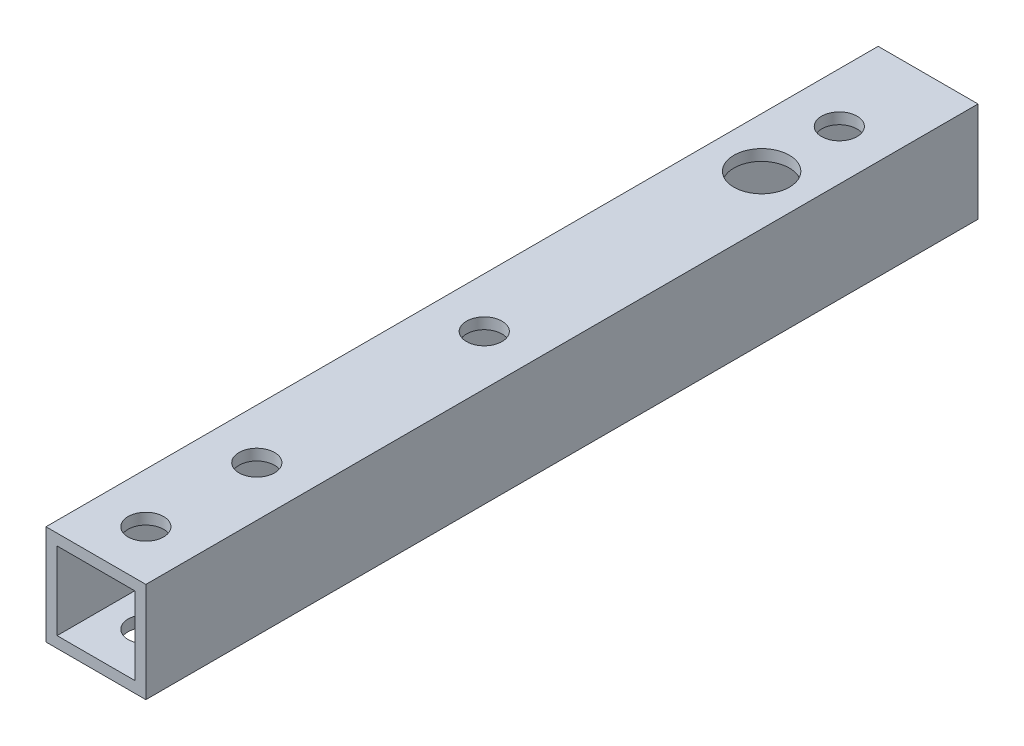
ISO-10303-21;
HEADER;
FILE_DESCRIPTION(('STEP AP214'),'2;1');
FILE_NAME('part.step','',(''),(''),'','','');
FILE_SCHEMA(('AUTOMOTIVE_DESIGN { 1 0 10303 214 1 1 1 1 }'));
ENDSEC;
DATA;
#1=APPLICATION_CONTEXT('core data for automotive mechanical design processes');
#2=APPLICATION_PROTOCOL_DEFINITION('international standard','automotive_design',2000,#1);
#3=PRODUCT_CONTEXT('',#1,'mechanical');
#4=PRODUCT('Part','Part','',(#3));
#5=PRODUCT_RELATED_PRODUCT_CATEGORY('part','',(#4));
#6=PRODUCT_DEFINITION_FORMATION('','',#4);
#7=PRODUCT_DEFINITION_CONTEXT('part definition',#1,'design');
#8=PRODUCT_DEFINITION('design','',#6,#7);
#9=PRODUCT_DEFINITION_SHAPE('','',#8);
#10=(LENGTH_UNIT() NAMED_UNIT(*) SI_UNIT(.MILLI.,.METRE.));
#11=(NAMED_UNIT(*) PLANE_ANGLE_UNIT() SI_UNIT($,.RADIAN.));
#12=(NAMED_UNIT(*) SI_UNIT($,.STERADIAN.) SOLID_ANGLE_UNIT());
#13=UNCERTAINTY_MEASURE_WITH_UNIT(LENGTH_MEASURE(1.E-05),#10,'distance_accuracy_value','');
#14=(GEOMETRIC_REPRESENTATION_CONTEXT(3) GLOBAL_UNCERTAINTY_ASSIGNED_CONTEXT((#13)) GLOBAL_UNIT_ASSIGNED_CONTEXT((#10,
#11,#12)) REPRESENTATION_CONTEXT('',''));
#15=CARTESIAN_POINT('',(0.,0.,0.));
#16=DIRECTION('',(0.,0.,1.));
#17=DIRECTION('',(1.,0.,0.));
#18=AXIS2_PLACEMENT_3D('',#15,#16,#17);
#19=CARTESIAN_POINT('',(0.,0.,70.));
#20=DIRECTION('',(0.,0.,1.));
#21=DIRECTION('',(1.,0.,0.));
#22=AXIS2_PLACEMENT_3D('',#19,#20,#21);
#23=PLANE('',#22);
#24=DIRECTION('',(0.,1.,0.));
#25=VECTOR('',#24,1.);
#26=CARTESIAN_POINT('',(4.5,4.5,70.));
#27=LINE('',#26,#25);
#28=CARTESIAN_POINT('',(4.5,-4.5,70.));
#29=VERTEX_POINT('',#28);
#30=CARTESIAN_POINT('',(4.5,4.5,70.));
#31=VERTEX_POINT('',#30);
#32=EDGE_CURVE('E213',#29,#31,#27,.T.);
#33=ORIENTED_EDGE('',*,*,#32,.T.);
#34=DIRECTION('',(-1.,0.,0.));
#35=VECTOR('',#34,1.);
#36=CARTESIAN_POINT('',(-4.5,4.5,70.));
#37=LINE('',#36,#35);
#38=CARTESIAN_POINT('',(-4.5,4.5,70.));
#39=VERTEX_POINT('',#38);
#40=EDGE_CURVE('E215',#31,#39,#37,.T.);
#41=ORIENTED_EDGE('',*,*,#40,.T.);
#42=DIRECTION('',(0.,-1.,0.));
#43=VECTOR('',#42,1.);
#44=CARTESIAN_POINT('',(-4.5,4.5,70.));
#45=LINE('',#44,#43);
#46=CARTESIAN_POINT('',(-4.5,-4.5,70.));
#47=VERTEX_POINT('',#46);
#48=EDGE_CURVE('E217',#39,#47,#45,.T.);
#49=ORIENTED_EDGE('',*,*,#48,.T.);
#50=DIRECTION('',(1.,0.,0.));
#51=VECTOR('',#50,1.);
#52=CARTESIAN_POINT('',(-4.5,-4.5,70.));
#53=LINE('',#52,#51);
#54=EDGE_CURVE('E73',#47,#29,#53,.T.);
#55=ORIENTED_EDGE('',*,*,#54,.T.);
#56=EDGE_LOOP('',(#33,#41,#49,#55));
#57=FACE_BOUND('',#56,.T.);
#58=DIRECTION('',(-1.,0.,0.));
#59=VECTOR('',#58,1.);
#60=CARTESIAN_POINT('',(-3.5,3.5,70.));
#61=LINE('',#60,#59);
#62=CARTESIAN_POINT('',(3.5,3.5,70.));
#63=VERTEX_POINT('',#62);
#64=CARTESIAN_POINT('',(-3.5,3.5,70.));
#65=VERTEX_POINT('',#64);
#66=EDGE_CURVE('E204',#63,#65,#61,.T.);
#67=ORIENTED_EDGE('',*,*,#66,.F.);
#68=DIRECTION('',(0.,1.,0.));
#69=VECTOR('',#68,1.);
#70=CARTESIAN_POINT('',(3.5,3.5,70.));
#71=LINE('',#70,#69);
#72=CARTESIAN_POINT('',(3.5,-3.5,70.));
#73=VERTEX_POINT('',#72);
#74=EDGE_CURVE('E202',#73,#63,#71,.T.);
#75=ORIENTED_EDGE('',*,*,#74,.F.);
#76=DIRECTION('',(1.,0.,0.));
#77=VECTOR('',#76,1.);
#78=CARTESIAN_POINT('',(-3.5,-3.5,70.));
#79=LINE('',#78,#77);
#80=CARTESIAN_POINT('',(-3.5,-3.5,70.));
#81=VERTEX_POINT('',#80);
#82=EDGE_CURVE('E120',#81,#73,#79,.T.);
#83=ORIENTED_EDGE('',*,*,#82,.F.);
#84=DIRECTION('',(0.,-1.,0.));
#85=VECTOR('',#84,1.);
#86=CARTESIAN_POINT('',(-3.5,3.5,70.));
#87=LINE('',#86,#85);
#88=EDGE_CURVE('E206',#65,#81,#87,.T.);
#89=ORIENTED_EDGE('',*,*,#88,.F.);
#90=EDGE_LOOP('',(#67,#75,#83,#89));
#91=FACE_BOUND('',#90,.T.);
#92=ADVANCED_FACE('F48',(#57,#91),#23,.T.);
#93=CARTESIAN_POINT('',(4.5,4.5,70.));
#94=DIRECTION('',(-1.,0.,0.));
#95=DIRECTION('',(0.,-1.,0.));
#96=AXIS2_PLACEMENT_3D('',#93,#94,#95);
#97=PLANE('',#96);
#98=DIRECTION('',(0.,0.,-1.));
#99=VECTOR('',#98,1.);
#100=CARTESIAN_POINT('',(4.5,-4.5,70.));
#101=LINE('',#100,#99);
#102=CARTESIAN_POINT('',(4.5,-4.5,-5.));
#103=VERTEX_POINT('',#102);
#104=EDGE_CURVE('E220',#29,#103,#101,.T.);
#105=ORIENTED_EDGE('',*,*,#104,.T.);
#106=DIRECTION('',(0.,-1.,0.));
#107=VECTOR('',#106,1.);
#108=CARTESIAN_POINT('',(4.5,-4.5,-5.));
#109=LINE('',#108,#107);
#110=CARTESIAN_POINT('',(4.5,4.5,-5.));
#111=VERTEX_POINT('',#110);
#112=EDGE_CURVE('E141',#111,#103,#109,.T.);
#113=ORIENTED_EDGE('',*,*,#112,.F.);
#114=DIRECTION('',(0.,0.,-1.));
#115=VECTOR('',#114,1.);
#116=CARTESIAN_POINT('',(4.5,4.5,70.));
#117=LINE('',#116,#115);
#118=EDGE_CURVE('E12',#31,#111,#117,.T.);
#119=ORIENTED_EDGE('',*,*,#118,.F.);
#120=ORIENTED_EDGE('',*,*,#32,.F.);
#121=EDGE_LOOP('',(#105,#113,#119,#120));
#122=FACE_BOUND('',#121,.T.);
#123=ADVANCED_FACE('F50',(#122),#97,.F.);
#124=CARTESIAN_POINT('',(-4.5,4.5,70.));
#125=DIRECTION('',(0.,-1.,0.));
#126=DIRECTION('',(0.,0.,-1.));
#127=AXIS2_PLACEMENT_3D('',#124,#125,#126);
#128=PLANE('',#127);
#129=CARTESIAN_POINT('',(0.,4.5,35.));
#130=DIRECTION('',(0.,1.,0.));
#131=DIRECTION('',(0.,0.,1.));
#132=AXIS2_PLACEMENT_3D('',#129,#130,#131);
#133=CIRCLE('',#132,1.6);
#134=CARTESIAN_POINT('',(0.,4.5,36.6));
#135=VERTEX_POINT('',#134);
#136=EDGE_CURVE('E153',#135,#135,#133,.T.);
#137=ORIENTED_EDGE('',*,*,#136,.F.);
#138=EDGE_LOOP('',(#137));
#139=FACE_BOUND('',#138,.T.);
#140=CARTESIAN_POINT('',(0.,4.5,55.5));
#141=DIRECTION('',(0.,1.,0.));
#142=DIRECTION('',(0.,0.,1.));
#143=AXIS2_PLACEMENT_3D('',#140,#141,#142);
#144=CIRCLE('',#143,1.6);
#145=CARTESIAN_POINT('',(0.,4.5,57.1));
#146=VERTEX_POINT('',#145);
#147=EDGE_CURVE('E163',#146,#146,#144,.T.);
#148=ORIENTED_EDGE('',*,*,#147,.F.);
#149=EDGE_LOOP('',(#148));
#150=FACE_BOUND('',#149,.T.);
#151=CARTESIAN_POINT('',(0.,4.5,65.5));
#152=DIRECTION('',(0.,1.,0.));
#153=DIRECTION('',(0.,0.,1.));
#154=AXIS2_PLACEMENT_3D('',#151,#152,#153);
#155=CIRCLE('',#154,1.6);
#156=CARTESIAN_POINT('',(0.,4.5,67.1));
#157=VERTEX_POINT('',#156);
#158=EDGE_CURVE('E162',#157,#157,#155,.T.);
#159=ORIENTED_EDGE('',*,*,#158,.F.);
#160=EDGE_LOOP('',(#159));
#161=FACE_BOUND('',#160,.T.);
#162=CARTESIAN_POINT('',(0.,4.5,3.));
#163=DIRECTION('',(0.,1.,0.));
#164=DIRECTION('',(0.,0.,1.));
#165=AXIS2_PLACEMENT_3D('',#162,#163,#164);
#166=CIRCLE('',#165,1.6);
#167=CARTESIAN_POINT('',(0.,4.5,4.6));
#168=VERTEX_POINT('',#167);
#169=EDGE_CURVE('E182',#168,#168,#166,.T.);
#170=ORIENTED_EDGE('',*,*,#169,.F.);
#171=EDGE_LOOP('',(#170));
#172=FACE_BOUND('',#171,.T.);
#173=CARTESIAN_POINT('',(0.,4.5,10.));
#174=DIRECTION('',(0.,1.,0.));
#175=DIRECTION('',(0.,0.,1.));
#176=AXIS2_PLACEMENT_3D('',#173,#174,#175);
#177=CIRCLE('',#176,2.5);
#178=CARTESIAN_POINT('',(0.,4.5,12.5));
#179=VERTEX_POINT('',#178);
#180=EDGE_CURVE('E192',#179,#179,#177,.T.);
#181=ORIENTED_EDGE('',*,*,#180,.F.);
#182=EDGE_LOOP('',(#181));
#183=FACE_BOUND('',#182,.T.);
#184=ORIENTED_EDGE('',*,*,#118,.T.);
#185=DIRECTION('',(1.,0.,0.));
#186=VECTOR('',#185,1.);
#187=CARTESIAN_POINT('',(-4.5,4.5,-5.));
#188=LINE('',#187,#186);
#189=CARTESIAN_POINT('',(-4.5,4.5,-5.));
#190=VERTEX_POINT('',#189);
#191=EDGE_CURVE('E150',#190,#111,#188,.T.);
#192=ORIENTED_EDGE('',*,*,#191,.F.);
#193=DIRECTION('',(0.,0.,-1.));
#194=VECTOR('',#193,1.);
#195=CARTESIAN_POINT('',(-4.5,4.5,70.));
#196=LINE('',#195,#194);
#197=EDGE_CURVE('E57',#39,#190,#196,.T.);
#198=ORIENTED_EDGE('',*,*,#197,.F.);
#199=ORIENTED_EDGE('',*,*,#40,.F.);
#200=EDGE_LOOP('',(#184,#192,#198,#199));
#201=FACE_BOUND('',#200,.T.);
#202=ADVANCED_FACE('F270',(#139,#150,#161,#172,#183,#201),#128,.F.);
#203=CARTESIAN_POINT('',(-4.5,4.5,70.));
#204=DIRECTION('',(1.,0.,0.));
#205=DIRECTION('',(0.,1.,0.));
#206=AXIS2_PLACEMENT_3D('',#203,#204,#205);
#207=PLANE('',#206);
#208=ORIENTED_EDGE('',*,*,#197,.T.);
#209=DIRECTION('',(0.,1.,0.));
#210=VECTOR('',#209,1.);
#211=CARTESIAN_POINT('',(-4.5,-4.5,-5.));
#212=LINE('',#211,#210);
#213=CARTESIAN_POINT('',(-4.5,-4.5,-5.));
#214=VERTEX_POINT('',#213);
#215=EDGE_CURVE('E147',#214,#190,#212,.T.);
#216=ORIENTED_EDGE('',*,*,#215,.F.);
#217=DIRECTION('',(0.,0.,-1.));
#218=VECTOR('',#217,1.);
#219=CARTESIAN_POINT('',(-4.5,-4.5,70.));
#220=LINE('',#219,#218);
#221=EDGE_CURVE('E222',#47,#214,#220,.T.);
#222=ORIENTED_EDGE('',*,*,#221,.F.);
#223=ORIENTED_EDGE('',*,*,#48,.F.);
#224=EDGE_LOOP('',(#208,#216,#222,#223));
#225=FACE_BOUND('',#224,.T.);
#226=ADVANCED_FACE('F257',(#225),#207,.F.);
#227=CARTESIAN_POINT('',(-4.5,-4.5,70.));
#228=DIRECTION('',(0.,1.,0.));
#229=DIRECTION('',(0.,0.,1.));
#230=AXIS2_PLACEMENT_3D('',#227,#228,#229);
#231=PLANE('',#230);
#232=CARTESIAN_POINT('',(0.,-4.5,35.));
#233=DIRECTION('',(0.,1.,0.));
#234=DIRECTION('',(0.,0.,1.));
#235=AXIS2_PLACEMENT_3D('',#232,#233,#234);
#236=CIRCLE('',#235,1.6);
#237=CARTESIAN_POINT('',(0.,-4.5,36.6));
#238=VERTEX_POINT('',#237);
#239=EDGE_CURVE('E154',#238,#238,#236,.T.);
#240=ORIENTED_EDGE('',*,*,#239,.T.);
#241=EDGE_LOOP('',(#240));
#242=FACE_BOUND('',#241,.T.);
#243=CARTESIAN_POINT('',(0.,-4.5,55.5));
#244=DIRECTION('',(0.,1.,0.));
#245=DIRECTION('',(0.,0.,1.));
#246=AXIS2_PLACEMENT_3D('',#243,#244,#245);
#247=CIRCLE('',#246,1.6);
#248=CARTESIAN_POINT('',(0.,-4.5,57.1));
#249=VERTEX_POINT('',#248);
#250=EDGE_CURVE('E179',#249,#249,#247,.T.);
#251=ORIENTED_EDGE('',*,*,#250,.T.);
#252=EDGE_LOOP('',(#251));
#253=FACE_BOUND('',#252,.T.);
#254=CARTESIAN_POINT('',(0.,-4.5,65.5));
#255=DIRECTION('',(0.,1.,0.));
#256=DIRECTION('',(0.,0.,1.));
#257=AXIS2_PLACEMENT_3D('',#254,#255,#256);
#258=CIRCLE('',#257,1.6);
#259=CARTESIAN_POINT('',(0.,-4.5,67.1));
#260=VERTEX_POINT('',#259);
#261=EDGE_CURVE('E172',#260,#260,#258,.T.);
#262=ORIENTED_EDGE('',*,*,#261,.T.);
#263=EDGE_LOOP('',(#262));
#264=FACE_BOUND('',#263,.T.);
#265=CARTESIAN_POINT('',(0.,-4.5,3.));
#266=DIRECTION('',(0.,1.,0.));
#267=DIRECTION('',(0.,0.,1.));
#268=AXIS2_PLACEMENT_3D('',#265,#266,#267);
#269=CIRCLE('',#268,1.6);
#270=CARTESIAN_POINT('',(0.,-4.5,4.6));
#271=VERTEX_POINT('',#270);
#272=EDGE_CURVE('E189',#271,#271,#269,.T.);
#273=ORIENTED_EDGE('',*,*,#272,.T.);
#274=EDGE_LOOP('',(#273));
#275=FACE_BOUND('',#274,.T.);
#276=CARTESIAN_POINT('',(0.,-4.5,10.));
#277=DIRECTION('',(0.,1.,0.));
#278=DIRECTION('',(0.,0.,1.));
#279=AXIS2_PLACEMENT_3D('',#276,#277,#278);
#280=CIRCLE('',#279,2.5);
#281=CARTESIAN_POINT('',(0.,-4.5,12.5));
#282=VERTEX_POINT('',#281);
#283=EDGE_CURVE('E199',#282,#282,#280,.T.);
#284=ORIENTED_EDGE('',*,*,#283,.T.);
#285=EDGE_LOOP('',(#284));
#286=FACE_BOUND('',#285,.T.);
#287=ORIENTED_EDGE('',*,*,#221,.T.);
#288=DIRECTION('',(-1.,0.,0.));
#289=VECTOR('',#288,1.);
#290=CARTESIAN_POINT('',(-4.5,-4.5,-5.));
#291=LINE('',#290,#289);
#292=EDGE_CURVE('E144',#103,#214,#291,.T.);
#293=ORIENTED_EDGE('',*,*,#292,.F.);
#294=ORIENTED_EDGE('',*,*,#104,.F.);
#295=ORIENTED_EDGE('',*,*,#54,.F.);
#296=EDGE_LOOP('',(#287,#293,#294,#295));
#297=FACE_BOUND('',#296,.T.);
#298=ADVANCED_FACE('F254',(#242,#253,#264,#275,#286,#297),#231,.F.);
#299=CARTESIAN_POINT('',(3.5,3.5,70.));
#300=DIRECTION('',(-1.,0.,0.));
#301=DIRECTION('',(0.,-1.,0.));
#302=AXIS2_PLACEMENT_3D('',#299,#300,#301);
#303=PLANE('',#302);
#304=DIRECTION('',(0.,0.,-1.));
#305=VECTOR('',#304,1.);
#306=CARTESIAN_POINT('',(3.5,3.5,70.));
#307=LINE('',#306,#305);
#308=CARTESIAN_POINT('',(3.5,3.5,-5.));
#309=VERTEX_POINT('',#308);
#310=EDGE_CURVE('E128',#63,#309,#307,.T.);
#311=ORIENTED_EDGE('',*,*,#310,.T.);
#312=DIRECTION('',(0.,-1.,0.));
#313=VECTOR('',#312,1.);
#314=CARTESIAN_POINT('',(3.5,-3.5,-5.));
#315=LINE('',#314,#313);
#316=CARTESIAN_POINT('',(3.5,-3.5,-5.));
#317=VERTEX_POINT('',#316);
#318=EDGE_CURVE('E125',#309,#317,#315,.T.);
#319=ORIENTED_EDGE('',*,*,#318,.T.);
#320=DIRECTION('',(0.,0.,-1.));
#321=VECTOR('',#320,1.);
#322=CARTESIAN_POINT('',(3.5,-3.5,70.));
#323=LINE('',#322,#321);
#324=EDGE_CURVE('E113',#73,#317,#323,.T.);
#325=ORIENTED_EDGE('',*,*,#324,.F.);
#326=ORIENTED_EDGE('',*,*,#74,.T.);
#327=EDGE_LOOP('',(#311,#319,#325,#326));
#328=FACE_BOUND('',#327,.T.);
#329=ADVANCED_FACE('F126',(#328),#303,.T.);
#330=CARTESIAN_POINT('',(-3.5,3.5,70.));
#331=DIRECTION('',(0.,-1.,0.));
#332=DIRECTION('',(0.,0.,-1.));
#333=AXIS2_PLACEMENT_3D('',#330,#331,#332);
#334=PLANE('',#333);
#335=CARTESIAN_POINT('',(0.,3.5,35.));
#336=DIRECTION('',(0.,-1.,0.));
#337=DIRECTION('',(0.,0.,-1.));
#338=AXIS2_PLACEMENT_3D('',#335,#336,#337);
#339=CIRCLE('',#338,1.6);
#340=CARTESIAN_POINT('',(0.,3.5,33.4));
#341=VERTEX_POINT('',#340);
#342=EDGE_CURVE('E159',#341,#341,#339,.T.);
#343=ORIENTED_EDGE('',*,*,#342,.F.);
#344=EDGE_LOOP('',(#343));
#345=FACE_BOUND('',#344,.T.);
#346=CARTESIAN_POINT('',(0.,3.5,55.5));
#347=DIRECTION('',(0.,-1.,0.));
#348=DIRECTION('',(0.,0.,-1.));
#349=AXIS2_PLACEMENT_3D('',#346,#347,#348);
#350=CIRCLE('',#349,1.6);
#351=CARTESIAN_POINT('',(0.,3.5,53.9));
#352=VERTEX_POINT('',#351);
#353=EDGE_CURVE('E176',#352,#352,#350,.T.);
#354=ORIENTED_EDGE('',*,*,#353,.F.);
#355=EDGE_LOOP('',(#354));
#356=FACE_BOUND('',#355,.T.);
#357=CARTESIAN_POINT('',(0.,3.5,65.5));
#358=DIRECTION('',(0.,-1.,0.));
#359=DIRECTION('',(0.,0.,-1.));
#360=AXIS2_PLACEMENT_3D('',#357,#358,#359);
#361=CIRCLE('',#360,1.6);
#362=CARTESIAN_POINT('',(0.,3.5,63.9));
#363=VERTEX_POINT('',#362);
#364=EDGE_CURVE('E169',#363,#363,#361,.T.);
#365=ORIENTED_EDGE('',*,*,#364,.F.);
#366=EDGE_LOOP('',(#365));
#367=FACE_BOUND('',#366,.T.);
#368=CARTESIAN_POINT('',(0.,3.5,3.));
#369=DIRECTION('',(0.,-1.,0.));
#370=DIRECTION('',(0.,0.,-1.));
#371=AXIS2_PLACEMENT_3D('',#368,#369,#370);
#372=CIRCLE('',#371,1.6);
#373=CARTESIAN_POINT('',(0.,3.5,1.4));
#374=VERTEX_POINT('',#373);
#375=EDGE_CURVE('E186',#374,#374,#372,.T.);
#376=ORIENTED_EDGE('',*,*,#375,.F.);
#377=EDGE_LOOP('',(#376));
#378=FACE_BOUND('',#377,.T.);
#379=CARTESIAN_POINT('',(0.,3.5,10.));
#380=DIRECTION('',(0.,-1.,0.));
#381=DIRECTION('',(0.,0.,-1.));
#382=AXIS2_PLACEMENT_3D('',#379,#380,#381);
#383=CIRCLE('',#382,2.5);
#384=CARTESIAN_POINT('',(0.,3.5,7.5));
#385=VERTEX_POINT('',#384);
#386=EDGE_CURVE('E196',#385,#385,#383,.T.);
#387=ORIENTED_EDGE('',*,*,#386,.F.);
#388=EDGE_LOOP('',(#387));
#389=FACE_BOUND('',#388,.T.);
#390=DIRECTION('',(0.,0.,-1.));
#391=VECTOR('',#390,1.);
#392=CARTESIAN_POINT('',(-3.5,3.5,70.));
#393=LINE('',#392,#391);
#394=CARTESIAN_POINT('',(-3.5,3.5,-5.));
#395=VERTEX_POINT('',#394);
#396=EDGE_CURVE('E210',#65,#395,#393,.T.);
#397=ORIENTED_EDGE('',*,*,#396,.T.);
#398=DIRECTION('',(1.,0.,0.));
#399=VECTOR('',#398,1.);
#400=CARTESIAN_POINT('',(-3.5,3.5,-5.));
#401=LINE('',#400,#399);
#402=EDGE_CURVE('E137',#395,#309,#401,.T.);
#403=ORIENTED_EDGE('',*,*,#402,.T.);
#404=ORIENTED_EDGE('',*,*,#310,.F.);
#405=ORIENTED_EDGE('',*,*,#66,.T.);
#406=EDGE_LOOP('',(#397,#403,#404,#405));
#407=FACE_BOUND('',#406,.T.);
#408=ADVANCED_FACE('F281',(#345,#356,#367,#378,#389,#407),#334,.T.);
#409=CARTESIAN_POINT('',(-3.5,3.5,70.));
#410=DIRECTION('',(1.,0.,0.));
#411=DIRECTION('',(0.,1.,0.));
#412=AXIS2_PLACEMENT_3D('',#409,#410,#411);
#413=PLANE('',#412);
#414=DIRECTION('',(0.,0.,-1.));
#415=VECTOR('',#414,1.);
#416=CARTESIAN_POINT('',(-3.5,-3.5,70.));
#417=LINE('',#416,#415);
#418=CARTESIAN_POINT('',(-3.5,-3.5,-5.));
#419=VERTEX_POINT('',#418);
#420=EDGE_CURVE('E65',#81,#419,#417,.T.);
#421=ORIENTED_EDGE('',*,*,#420,.T.);
#422=DIRECTION('',(0.,1.,0.));
#423=VECTOR('',#422,1.);
#424=CARTESIAN_POINT('',(-3.5,-3.5,-5.));
#425=LINE('',#424,#423);
#426=EDGE_CURVE('E135',#419,#395,#425,.T.);
#427=ORIENTED_EDGE('',*,*,#426,.T.);
#428=ORIENTED_EDGE('',*,*,#396,.F.);
#429=ORIENTED_EDGE('',*,*,#88,.T.);
#430=EDGE_LOOP('',(#421,#427,#428,#429));
#431=FACE_BOUND('',#430,.T.);
#432=ADVANCED_FACE('F239',(#431),#413,.T.);
#433=CARTESIAN_POINT('',(-3.5,-3.5,70.));
#434=DIRECTION('',(0.,1.,0.));
#435=DIRECTION('',(0.,0.,1.));
#436=AXIS2_PLACEMENT_3D('',#433,#434,#435);
#437=PLANE('',#436);
#438=CARTESIAN_POINT('',(0.,-3.5,35.));
#439=DIRECTION('',(0.,1.,0.));
#440=DIRECTION('',(0.,0.,1.));
#441=AXIS2_PLACEMENT_3D('',#438,#439,#440);
#442=CIRCLE('',#441,1.6);
#443=CARTESIAN_POINT('',(0.,-3.5,36.6));
#444=VERTEX_POINT('',#443);
#445=EDGE_CURVE('E52',#444,#444,#442,.T.);
#446=ORIENTED_EDGE('',*,*,#445,.F.);
#447=EDGE_LOOP('',(#446));
#448=FACE_BOUND('',#447,.T.);
#449=CARTESIAN_POINT('',(0.,-3.5,55.5));
#450=DIRECTION('',(0.,1.,0.));
#451=DIRECTION('',(0.,0.,1.));
#452=AXIS2_PLACEMENT_3D('',#449,#450,#451);
#453=CIRCLE('',#452,1.6);
#454=CARTESIAN_POINT('',(0.,-3.5,57.1));
#455=VERTEX_POINT('',#454);
#456=EDGE_CURVE('E175',#455,#455,#453,.T.);
#457=ORIENTED_EDGE('',*,*,#456,.F.);
#458=EDGE_LOOP('',(#457));
#459=FACE_BOUND('',#458,.T.);
#460=CARTESIAN_POINT('',(0.,-3.5,65.5));
#461=DIRECTION('',(0.,1.,0.));
#462=DIRECTION('',(0.,0.,1.));
#463=AXIS2_PLACEMENT_3D('',#460,#461,#462);
#464=CIRCLE('',#463,1.6);
#465=CARTESIAN_POINT('',(0.,-3.5,67.1));
#466=VERTEX_POINT('',#465);
#467=EDGE_CURVE('E166',#466,#466,#464,.T.);
#468=ORIENTED_EDGE('',*,*,#467,.F.);
#469=EDGE_LOOP('',(#468));
#470=FACE_BOUND('',#469,.T.);
#471=CARTESIAN_POINT('',(0.,-3.5,3.));
#472=DIRECTION('',(0.,1.,0.));
#473=DIRECTION('',(0.,0.,1.));
#474=AXIS2_PLACEMENT_3D('',#471,#472,#473);
#475=CIRCLE('',#474,1.6);
#476=CARTESIAN_POINT('',(0.,-3.5,4.6));
#477=VERTEX_POINT('',#476);
#478=EDGE_CURVE('E185',#477,#477,#475,.T.);
#479=ORIENTED_EDGE('',*,*,#478,.F.);
#480=EDGE_LOOP('',(#479));
#481=FACE_BOUND('',#480,.T.);
#482=CARTESIAN_POINT('',(0.,-3.5,10.));
#483=DIRECTION('',(0.,1.,0.));
#484=DIRECTION('',(0.,0.,1.));
#485=AXIS2_PLACEMENT_3D('',#482,#483,#484);
#486=CIRCLE('',#485,2.5);
#487=CARTESIAN_POINT('',(0.,-3.5,12.5));
#488=VERTEX_POINT('',#487);
#489=EDGE_CURVE('E195',#488,#488,#486,.T.);
#490=ORIENTED_EDGE('',*,*,#489,.F.);
#491=EDGE_LOOP('',(#490));
#492=FACE_BOUND('',#491,.T.);
#493=ORIENTED_EDGE('',*,*,#324,.T.);
#494=DIRECTION('',(-1.,0.,0.));
#495=VECTOR('',#494,1.);
#496=CARTESIAN_POINT('',(-3.5,-3.5,-5.));
#497=LINE('',#496,#495);
#498=EDGE_CURVE('E117',#317,#419,#497,.T.);
#499=ORIENTED_EDGE('',*,*,#498,.T.);
#500=ORIENTED_EDGE('',*,*,#420,.F.);
#501=ORIENTED_EDGE('',*,*,#82,.T.);
#502=EDGE_LOOP('',(#493,#499,#500,#501));
#503=FACE_BOUND('',#502,.T.);
#504=ADVANCED_FACE('F115',(#448,#459,#470,#481,#492,#503),#437,.T.);
#505=CARTESIAN_POINT('',(0.,-95.5,10.));
#506=DIRECTION('',(0.,1.,0.));
#507=DIRECTION('',(0.,0.,1.));
#508=AXIS2_PLACEMENT_3D('',#505,#506,#507);
#509=CYLINDRICAL_SURFACE('',#508,2.5);
#510=ORIENTED_EDGE('',*,*,#489,.T.);
#511=EDGE_LOOP('',(#510));
#512=FACE_BOUND('',#511,.T.);
#513=ORIENTED_EDGE('',*,*,#283,.F.);
#514=EDGE_LOOP('',(#513));
#515=FACE_BOUND('',#514,.T.);
#516=ADVANCED_FACE('F238',(#512,#515),#509,.F.);
#517=ORIENTED_EDGE('',*,*,#386,.T.);
#518=EDGE_LOOP('',(#517));
#519=FACE_BOUND('',#518,.T.);
#520=ORIENTED_EDGE('',*,*,#180,.T.);
#521=EDGE_LOOP('',(#520));
#522=FACE_BOUND('',#521,.T.);
#523=ADVANCED_FACE('F250',(#519,#522),#509,.F.);
#524=CARTESIAN_POINT('',(0.,-95.5,3.));
#525=DIRECTION('',(0.,1.,0.));
#526=DIRECTION('',(0.,0.,1.));
#527=AXIS2_PLACEMENT_3D('',#524,#525,#526);
#528=CYLINDRICAL_SURFACE('',#527,1.6);
#529=ORIENTED_EDGE('',*,*,#478,.T.);
#530=EDGE_LOOP('',(#529));
#531=FACE_BOUND('',#530,.T.);
#532=ORIENTED_EDGE('',*,*,#272,.F.);
#533=EDGE_LOOP('',(#532));
#534=FACE_BOUND('',#533,.T.);
#535=ADVANCED_FACE('F310',(#531,#534),#528,.F.);
#536=ORIENTED_EDGE('',*,*,#375,.T.);
#537=EDGE_LOOP('',(#536));
#538=FACE_BOUND('',#537,.T.);
#539=ORIENTED_EDGE('',*,*,#169,.T.);
#540=EDGE_LOOP('',(#539));
#541=FACE_BOUND('',#540,.T.);
#542=ADVANCED_FACE('F315',(#538,#541),#528,.F.);
#543=CARTESIAN_POINT('',(0.,-95.5,65.5));
#544=DIRECTION('',(0.,1.,0.));
#545=DIRECTION('',(0.,0.,1.));
#546=AXIS2_PLACEMENT_3D('',#543,#544,#545);
#547=CYLINDRICAL_SURFACE('',#546,1.6);
#548=ORIENTED_EDGE('',*,*,#467,.T.);
#549=EDGE_LOOP('',(#548));
#550=FACE_BOUND('',#549,.T.);
#551=ORIENTED_EDGE('',*,*,#261,.F.);
#552=EDGE_LOOP('',(#551));
#553=FACE_BOUND('',#552,.T.);
#554=ADVANCED_FACE('F319',(#550,#553),#547,.F.);
#555=CARTESIAN_POINT('',(0.,-95.5,55.5));
#556=DIRECTION('',(0.,1.,0.));
#557=DIRECTION('',(0.,0.,1.));
#558=AXIS2_PLACEMENT_3D('',#555,#556,#557);
#559=CYLINDRICAL_SURFACE('',#558,1.6);
#560=ORIENTED_EDGE('',*,*,#456,.T.);
#561=EDGE_LOOP('',(#560));
#562=FACE_BOUND('',#561,.T.);
#563=ORIENTED_EDGE('',*,*,#250,.F.);
#564=EDGE_LOOP('',(#563));
#565=FACE_BOUND('',#564,.T.);
#566=ADVANCED_FACE('F233',(#562,#565),#559,.F.);
#567=ORIENTED_EDGE('',*,*,#364,.T.);
#568=EDGE_LOOP('',(#567));
#569=FACE_BOUND('',#568,.T.);
#570=ORIENTED_EDGE('',*,*,#158,.T.);
#571=EDGE_LOOP('',(#570));
#572=FACE_BOUND('',#571,.T.);
#573=ADVANCED_FACE('F323',(#569,#572),#547,.F.);
#574=ORIENTED_EDGE('',*,*,#353,.T.);
#575=EDGE_LOOP('',(#574));
#576=FACE_BOUND('',#575,.T.);
#577=ORIENTED_EDGE('',*,*,#147,.T.);
#578=EDGE_LOOP('',(#577));
#579=FACE_BOUND('',#578,.T.);
#580=ADVANCED_FACE('F326',(#576,#579),#559,.F.);
#581=CARTESIAN_POINT('',(0.,-4.5,35.));
#582=DIRECTION('',(0.,1.,0.));
#583=DIRECTION('',(0.,0.,1.));
#584=AXIS2_PLACEMENT_3D('',#581,#582,#583);
#585=CYLINDRICAL_SURFACE('',#584,1.6);
#586=ORIENTED_EDGE('',*,*,#445,.T.);
#587=EDGE_LOOP('',(#586));
#588=FACE_BOUND('',#587,.T.);
#589=ORIENTED_EDGE('',*,*,#239,.F.);
#590=EDGE_LOOP('',(#589));
#591=FACE_BOUND('',#590,.T.);
#592=ADVANCED_FACE('F327',(#588,#591),#585,.F.);
#593=ORIENTED_EDGE('',*,*,#342,.T.);
#594=EDGE_LOOP('',(#593));
#595=FACE_BOUND('',#594,.T.);
#596=ORIENTED_EDGE('',*,*,#136,.T.);
#597=EDGE_LOOP('',(#596));
#598=FACE_BOUND('',#597,.T.);
#599=ADVANCED_FACE('F330',(#595,#598),#585,.F.);
#600=CARTESIAN_POINT('',(0.,0.,-5.));
#601=DIRECTION('',(0.,0.,-1.));
#602=DIRECTION('',(-1.,0.,0.));
#603=AXIS2_PLACEMENT_3D('',#600,#601,#602);
#604=PLANE('',#603);
#605=ORIENTED_EDGE('',*,*,#112,.T.);
#606=ORIENTED_EDGE('',*,*,#292,.T.);
#607=ORIENTED_EDGE('',*,*,#215,.T.);
#608=ORIENTED_EDGE('',*,*,#191,.T.);
#609=EDGE_LOOP('',(#605,#606,#607,#608));
#610=FACE_BOUND('',#609,.T.);
#611=ORIENTED_EDGE('',*,*,#498,.F.);
#612=ORIENTED_EDGE('',*,*,#318,.F.);
#613=ORIENTED_EDGE('',*,*,#402,.F.);
#614=ORIENTED_EDGE('',*,*,#426,.F.);
#615=EDGE_LOOP('',(#611,#612,#613,#614));
#616=FACE_BOUND('',#615,.T.);
#617=ADVANCED_FACE('F133',(#610,#616),#604,.T.);
#618=CLOSED_SHELL('',(#92,#123,#202,#226,#298,#329,#408,#432,#504,#516,#523,#535,#542,#554,#566,
#573,#580,#592,#599,#617));
#619=MANIFOLD_SOLID_BREP('B2',#618);
#620=ADVANCED_BREP_SHAPE_REPRESENTATION('',(#18,#619),#14);
#621=SHAPE_DEFINITION_REPRESENTATION(#9,#620);
ENDSEC;
END-ISO-10303-21;
